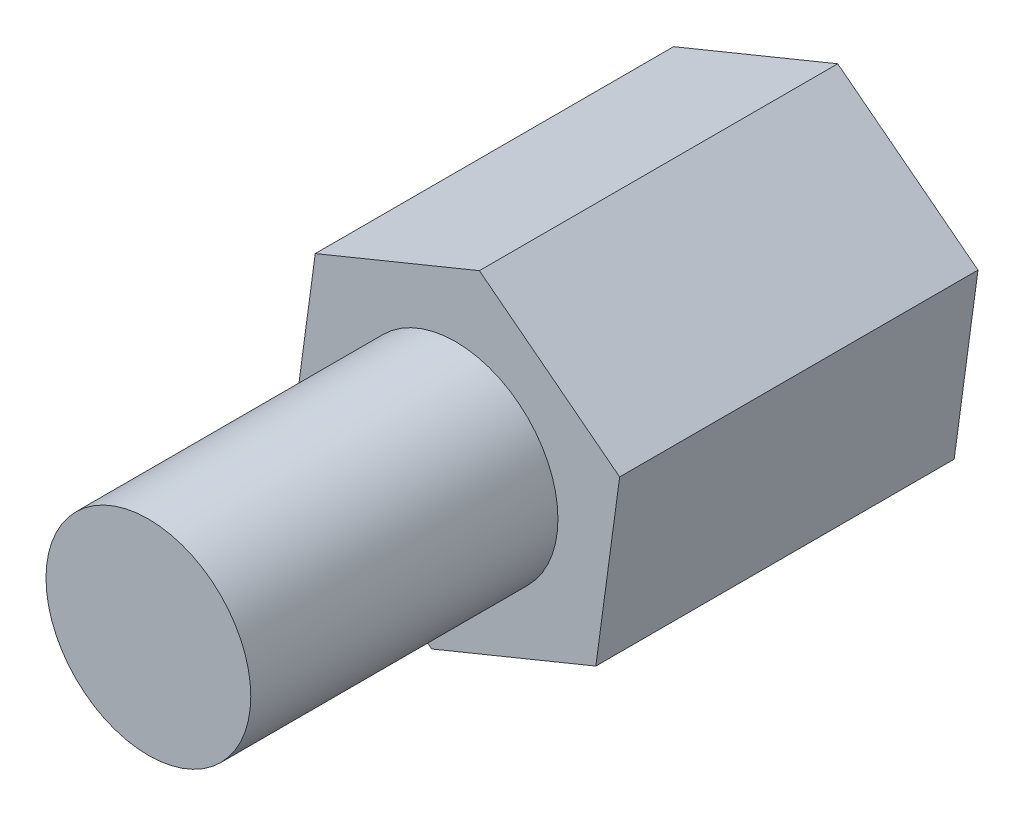
ISO-10303-21;
HEADER;
FILE_DESCRIPTION(('STEP AP214'),'2;1');
FILE_NAME('part.step','',(''),(''),'','','');
FILE_SCHEMA(('AUTOMOTIVE_DESIGN { 1 0 10303 214 1 1 1 1 }'));
ENDSEC;
DATA;
#1=APPLICATION_CONTEXT('core data for automotive mechanical design processes');
#2=APPLICATION_PROTOCOL_DEFINITION('international standard','automotive_design',2000,#1);
#3=PRODUCT_CONTEXT('',#1,'mechanical');
#4=PRODUCT('Part','Part','',(#3));
#5=PRODUCT_RELATED_PRODUCT_CATEGORY('part','',(#4));
#6=PRODUCT_DEFINITION_FORMATION('','',#4);
#7=PRODUCT_DEFINITION_CONTEXT('part definition',#1,'design');
#8=PRODUCT_DEFINITION('design','',#6,#7);
#9=PRODUCT_DEFINITION_SHAPE('','',#8);
#10=(LENGTH_UNIT() NAMED_UNIT(*) SI_UNIT(.MILLI.,.METRE.));
#11=(NAMED_UNIT(*) PLANE_ANGLE_UNIT() SI_UNIT($,.RADIAN.));
#12=(NAMED_UNIT(*) SI_UNIT($,.STERADIAN.) SOLID_ANGLE_UNIT());
#13=UNCERTAINTY_MEASURE_WITH_UNIT(LENGTH_MEASURE(1.E-05),#10,'distance_accuracy_value','');
#14=(GEOMETRIC_REPRESENTATION_CONTEXT(3) GLOBAL_UNCERTAINTY_ASSIGNED_CONTEXT((#13)) GLOBAL_UNIT_ASSIGNED_CONTEXT((#10,
#11,#12)) REPRESENTATION_CONTEXT('',''));
#15=CARTESIAN_POINT('',(0.,0.,0.));
#16=DIRECTION('',(0.,0.,1.));
#17=DIRECTION('',(1.,0.,0.));
#18=AXIS2_PLACEMENT_3D('',#15,#16,#17);
#19=CARTESIAN_POINT('',(-0.465240047696353,-3.43271782965328,7.));
#20=DIRECTION('',(-0.379160128826499,0.92533107410714,0.));
#21=DIRECTION('',(-0.92533107410714,-0.379160128826499,0.));
#22=AXIS2_PLACEMENT_3D('',#19,#20,#21);
#23=PLANE('',#22);
#24=DIRECTION('',(0.92533107410714,0.379160128826499,0.));
#25=VECTOR('',#24,1.);
#26=CARTESIAN_POINT('',(-0.465240047696353,-3.43271782965328,0.));
#27=LINE('',#26,#25);
#28=CARTESIAN_POINT('',(-0.465240047696353,-3.43271782965328,0.));
#29=VERTEX_POINT('',#28);
#30=CARTESIAN_POINT('',(2.74020082065534,-2.11926861498956,0.));
#31=VERTEX_POINT('',#30);
#32=EDGE_CURVE('E122',#29,#31,#27,.T.);
#33=ORIENTED_EDGE('',*,*,#32,.T.);
#34=DIRECTION('',(0.,0.,-1.));
#35=VECTOR('',#34,1.);
#36=CARTESIAN_POINT('',(2.74020082065534,-2.11926861498956,7.));
#37=LINE('',#36,#35);
#38=CARTESIAN_POINT('',(2.74020082065534,-2.11926861498956,7.));
#39=VERTEX_POINT('',#38);
#40=EDGE_CURVE('E39',#39,#31,#37,.T.);
#41=ORIENTED_EDGE('',*,*,#40,.F.);
#42=DIRECTION('',(0.92533107410714,0.379160128826499,0.));
#43=VECTOR('',#42,1.);
#44=CARTESIAN_POINT('',(-0.465240047696353,-3.43271782965328,7.));
#45=LINE('',#44,#43);
#46=CARTESIAN_POINT('',(-0.465240047696353,-3.43271782965328,7.));
#47=VERTEX_POINT('',#46);
#48=EDGE_CURVE('E133',#47,#39,#45,.T.);
#49=ORIENTED_EDGE('',*,*,#48,.F.);
#50=DIRECTION('',(0.,0.,-1.));
#51=VECTOR('',#50,1.);
#52=CARTESIAN_POINT('',(-0.465240047696353,-3.43271782965328,7.));
#53=LINE('',#52,#51);
#54=EDGE_CURVE('E118',#47,#29,#53,.T.);
#55=ORIENTED_EDGE('',*,*,#54,.T.);
#56=EDGE_LOOP('',(#33,#41,#49,#55));
#57=FACE_BOUND('',#56,.T.);
#58=ADVANCED_FACE('F36',(#57),#23,.F.);
#59=CARTESIAN_POINT('',(2.74020082065534,-2.11926861498956,7.));
#60=DIRECTION('',(-0.990940281501173,0.134303233387642,0.));
#61=DIRECTION('',(-0.134303233387642,-0.990940281501174,0.));
#62=AXIS2_PLACEMENT_3D('',#59,#60,#61);
#63=PLANE('',#62);
#64=DIRECTION('',(0.134303233387642,0.990940281501173,0.));
#65=VECTOR('',#64,1.);
#66=CARTESIAN_POINT('',(2.74020082065534,-2.11926861498956,0.));
#67=LINE('',#66,#65);
#68=CARTESIAN_POINT('',(3.2054408683517,1.31344921466371,0.));
#69=VERTEX_POINT('',#68);
#70=EDGE_CURVE('E125',#31,#69,#67,.T.);
#71=ORIENTED_EDGE('',*,*,#70,.T.);
#72=DIRECTION('',(0.,0.,-1.));
#73=VECTOR('',#72,1.);
#74=CARTESIAN_POINT('',(3.2054408683517,1.31344921466371,7.));
#75=LINE('',#74,#73);
#76=CARTESIAN_POINT('',(3.2054408683517,1.31344921466371,7.));
#77=VERTEX_POINT('',#76);
#78=EDGE_CURVE('E136',#77,#69,#75,.T.);
#79=ORIENTED_EDGE('',*,*,#78,.F.);
#80=DIRECTION('',(0.134303233387642,0.990940281501173,0.));
#81=VECTOR('',#80,1.);
#82=CARTESIAN_POINT('',(2.74020082065534,-2.11926861498956,7.));
#83=LINE('',#82,#81);
#84=EDGE_CURVE('E91',#39,#77,#83,.T.);
#85=ORIENTED_EDGE('',*,*,#84,.F.);
#86=ORIENTED_EDGE('',*,*,#40,.T.);
#87=EDGE_LOOP('',(#71,#79,#85,#86));
#88=FACE_BOUND('',#87,.T.);
#89=ADVANCED_FACE('F141',(#88),#63,.F.);
#90=CARTESIAN_POINT('',(3.2054408683517,1.31344921466371,7.));
#91=DIRECTION('',(-0.611780152674675,-0.791027840719498,0.));
#92=DIRECTION('',(0.791027840719498,-0.611780152674675,0.));
#93=AXIS2_PLACEMENT_3D('',#90,#91,#92);
#94=PLANE('',#93);
#95=DIRECTION('',(-0.791027840719498,0.611780152674675,0.));
#96=VECTOR('',#95,1.);
#97=CARTESIAN_POINT('',(3.2054408683517,1.31344921466371,0.));
#98=LINE('',#97,#96);
#99=CARTESIAN_POINT('',(0.465240047696353,3.43271782965328,0.));
#100=VERTEX_POINT('',#99);
#101=EDGE_CURVE('E128',#69,#100,#98,.T.);
#102=ORIENTED_EDGE('',*,*,#101,.T.);
#103=DIRECTION('',(0.,0.,-1.));
#104=VECTOR('',#103,1.);
#105=CARTESIAN_POINT('',(0.465240047696353,3.43271782965328,7.));
#106=LINE('',#105,#104);
#107=CARTESIAN_POINT('',(0.465240047696353,3.43271782965328,7.));
#108=VERTEX_POINT('',#107);
#109=EDGE_CURVE('E113',#108,#100,#106,.T.);
#110=ORIENTED_EDGE('',*,*,#109,.F.);
#111=DIRECTION('',(-0.791027840719498,0.611780152674675,0.));
#112=VECTOR('',#111,1.);
#113=CARTESIAN_POINT('',(3.2054408683517,1.31344921466371,7.));
#114=LINE('',#113,#112);
#115=EDGE_CURVE('E104',#77,#108,#114,.T.);
#116=ORIENTED_EDGE('',*,*,#115,.F.);
#117=ORIENTED_EDGE('',*,*,#78,.T.);
#118=EDGE_LOOP('',(#102,#110,#116,#117));
#119=FACE_BOUND('',#118,.T.);
#120=ADVANCED_FACE('F147',(#119),#94,.F.);
#121=CARTESIAN_POINT('',(0.465240047696353,3.43271782965328,7.));
#122=DIRECTION('',(0.379160128826498,-0.92533107410714,0.));
#123=DIRECTION('',(0.92533107410714,0.379160128826498,0.));
#124=AXIS2_PLACEMENT_3D('',#121,#122,#123);
#125=PLANE('',#124);
#126=DIRECTION('',(-0.92533107410714,-0.379160128826498,0.));
#127=VECTOR('',#126,1.);
#128=CARTESIAN_POINT('',(0.465240047696353,3.43271782965328,0.));
#129=LINE('',#128,#127);
#130=CARTESIAN_POINT('',(-2.74020082065534,2.11926861498956,0.));
#131=VERTEX_POINT('',#130);
#132=EDGE_CURVE('E112',#100,#131,#129,.T.);
#133=ORIENTED_EDGE('',*,*,#132,.T.);
#134=DIRECTION('',(0.,0.,-1.));
#135=VECTOR('',#134,1.);
#136=CARTESIAN_POINT('',(-2.74020082065534,2.11926861498956,7.));
#137=LINE('',#136,#135);
#138=CARTESIAN_POINT('',(-2.74020082065534,2.11926861498956,7.));
#139=VERTEX_POINT('',#138);
#140=EDGE_CURVE('E109',#139,#131,#137,.T.);
#141=ORIENTED_EDGE('',*,*,#140,.F.);
#142=DIRECTION('',(-0.92533107410714,-0.379160128826498,0.));
#143=VECTOR('',#142,1.);
#144=CARTESIAN_POINT('',(0.465240047696353,3.43271782965328,7.));
#145=LINE('',#144,#143);
#146=EDGE_CURVE('E98',#108,#139,#145,.T.);
#147=ORIENTED_EDGE('',*,*,#146,.F.);
#148=ORIENTED_EDGE('',*,*,#109,.T.);
#149=EDGE_LOOP('',(#133,#141,#147,#148));
#150=FACE_BOUND('',#149,.T.);
#151=ADVANCED_FACE('F110',(#150),#125,.F.);
#152=CARTESIAN_POINT('',(-2.74020082065534,2.11926861498956,7.));
#153=DIRECTION('',(0.990940281501173,-0.134303233387642,0.));
#154=DIRECTION('',(0.134303233387642,0.990940281501173,0.));
#155=AXIS2_PLACEMENT_3D('',#152,#153,#154);
#156=PLANE('',#155);
#157=DIRECTION('',(-0.134303233387642,-0.990940281501173,0.));
#158=VECTOR('',#157,1.);
#159=CARTESIAN_POINT('',(-2.74020082065534,2.11926861498956,0.));
#160=LINE('',#159,#158);
#161=CARTESIAN_POINT('',(-3.2054408683517,-1.31344921466371,0.));
#162=VERTEX_POINT('',#161);
#163=EDGE_CURVE('E76',#131,#162,#160,.T.);
#164=ORIENTED_EDGE('',*,*,#163,.T.);
#165=DIRECTION('',(0.,0.,-1.));
#166=VECTOR('',#165,1.);
#167=CARTESIAN_POINT('',(-3.2054408683517,-1.31344921466371,7.));
#168=LINE('',#167,#166);
#169=CARTESIAN_POINT('',(-3.2054408683517,-1.31344921466371,7.));
#170=VERTEX_POINT('',#169);
#171=EDGE_CURVE('E114',#170,#162,#168,.T.);
#172=ORIENTED_EDGE('',*,*,#171,.F.);
#173=DIRECTION('',(-0.134303233387642,-0.990940281501173,0.));
#174=VECTOR('',#173,1.);
#175=CARTESIAN_POINT('',(-2.74020082065534,2.11926861498956,7.));
#176=LINE('',#175,#174);
#177=EDGE_CURVE('E102',#139,#170,#176,.T.);
#178=ORIENTED_EDGE('',*,*,#177,.F.);
#179=ORIENTED_EDGE('',*,*,#140,.T.);
#180=EDGE_LOOP('',(#164,#172,#178,#179));
#181=FACE_BOUND('',#180,.T.);
#182=ADVANCED_FACE('F116',(#181),#156,.F.);
#183=CARTESIAN_POINT('',(-3.2054408683517,-1.31344921466371,7.));
#184=DIRECTION('',(0.611780152674675,0.791027840719498,0.));
#185=DIRECTION('',(-0.791027840719498,0.611780152674675,0.));
#186=AXIS2_PLACEMENT_3D('',#183,#184,#185);
#187=PLANE('',#186);
#188=DIRECTION('',(0.791027840719498,-0.611780152674675,0.));
#189=VECTOR('',#188,1.);
#190=CARTESIAN_POINT('',(-3.2054408683517,-1.31344921466371,0.));
#191=LINE('',#190,#189);
#192=EDGE_CURVE('E82',#162,#29,#191,.T.);
#193=ORIENTED_EDGE('',*,*,#192,.T.);
#194=ORIENTED_EDGE('',*,*,#54,.F.);
#195=DIRECTION('',(0.791027840719498,-0.611780152674675,0.));
#196=VECTOR('',#195,1.);
#197=CARTESIAN_POINT('',(-3.2054408683517,-1.31344921466371,7.));
#198=LINE('',#197,#196);
#199=EDGE_CURVE('E53',#170,#47,#198,.T.);
#200=ORIENTED_EDGE('',*,*,#199,.F.);
#201=ORIENTED_EDGE('',*,*,#171,.T.);
#202=EDGE_LOOP('',(#193,#194,#200,#201));
#203=FACE_BOUND('',#202,.T.);
#204=ADVANCED_FACE('F178',(#203),#187,.F.);
#205=CARTESIAN_POINT('',(0.,0.,7.));
#206=DIRECTION('',(0.,0.,1.));
#207=DIRECTION('',(1.,0.,0.));
#208=AXIS2_PLACEMENT_3D('',#205,#206,#207);
#209=PLANE('',#208);
#210=CARTESIAN_POINT('',(0.,0.,7.));
#211=DIRECTION('',(0.,0.,1.));
#212=DIRECTION('',(1.,0.,0.));
#213=AXIS2_PLACEMENT_3D('',#210,#211,#212);
#214=CIRCLE('',#213,2.);
#215=CARTESIAN_POINT('',(2.,0.,7.));
#216=VERTEX_POINT('',#215);
#217=EDGE_CURVE('E11',#216,#216,#214,.T.);
#218=ORIENTED_EDGE('',*,*,#217,.F.);
#219=EDGE_LOOP('',(#218));
#220=FACE_BOUND('',#219,.T.);
#221=ORIENTED_EDGE('',*,*,#48,.T.);
#222=ORIENTED_EDGE('',*,*,#84,.T.);
#223=ORIENTED_EDGE('',*,*,#115,.T.);
#224=ORIENTED_EDGE('',*,*,#146,.T.);
#225=ORIENTED_EDGE('',*,*,#177,.T.);
#226=ORIENTED_EDGE('',*,*,#199,.T.);
#227=EDGE_LOOP('',(#221,#222,#223,#224,#225,#226));
#228=FACE_BOUND('',#227,.T.);
#229=ADVANCED_FACE('F100',(#220,#228),#209,.T.);
#230=CARTESIAN_POINT('',(0.,0.,0.));
#231=DIRECTION('',(0.,0.,1.));
#232=DIRECTION('',(1.,0.,0.));
#233=AXIS2_PLACEMENT_3D('',#230,#231,#232);
#234=PLANE('',#233);
#235=CARTESIAN_POINT('',(0.,0.,0.));
#236=DIRECTION('',(0.,0.,-1.));
#237=DIRECTION('',(-1.,0.,0.));
#238=AXIS2_PLACEMENT_3D('',#235,#236,#237);
#239=CIRCLE('',#238,2.);
#240=CARTESIAN_POINT('',(-2.,0.,0.));
#241=VERTEX_POINT('',#240);
#242=EDGE_CURVE('E154',#241,#241,#239,.T.);
#243=ORIENTED_EDGE('',*,*,#242,.F.);
#244=EDGE_LOOP('',(#243));
#245=FACE_BOUND('',#244,.T.);
#246=ORIENTED_EDGE('',*,*,#32,.F.);
#247=ORIENTED_EDGE('',*,*,#192,.F.);
#248=ORIENTED_EDGE('',*,*,#163,.F.);
#249=ORIENTED_EDGE('',*,*,#132,.F.);
#250=ORIENTED_EDGE('',*,*,#101,.F.);
#251=ORIENTED_EDGE('',*,*,#70,.F.);
#252=EDGE_LOOP('',(#246,#247,#248,#249,#250,#251));
#253=FACE_BOUND('',#252,.T.);
#254=ADVANCED_FACE('F146',(#245,#253),#234,.F.);
#255=CARTESIAN_POINT('',(0.,0.,13.));
#256=DIRECTION('',(0.,0.,-1.));
#257=DIRECTION('',(-1.,0.,0.));
#258=AXIS2_PLACEMENT_3D('',#255,#256,#257);
#259=CYLINDRICAL_SURFACE('',#258,2.);
#260=CARTESIAN_POINT('',(0.,0.,13.));
#261=DIRECTION('',(0.,0.,1.));
#262=DIRECTION('',(1.,0.,0.));
#263=AXIS2_PLACEMENT_3D('',#260,#261,#262);
#264=CIRCLE('',#263,2.);
#265=CARTESIAN_POINT('',(2.,0.,13.));
#266=VERTEX_POINT('',#265);
#267=EDGE_CURVE('E126',#266,#266,#264,.T.);
#268=ORIENTED_EDGE('',*,*,#267,.F.);
#269=EDGE_LOOP('',(#268));
#270=FACE_BOUND('',#269,.T.);
#271=ORIENTED_EDGE('',*,*,#217,.T.);
#272=EDGE_LOOP('',(#271));
#273=FACE_BOUND('',#272,.T.);
#274=ADVANCED_FACE('F170',(#270,#273),#259,.T.);
#275=CARTESIAN_POINT('',(0.,0.,13.));
#276=DIRECTION('',(0.,0.,1.));
#277=DIRECTION('',(1.,0.,0.));
#278=AXIS2_PLACEMENT_3D('',#275,#276,#277);
#279=PLANE('',#278);
#280=ORIENTED_EDGE('',*,*,#267,.T.);
#281=EDGE_LOOP('',(#280));
#282=FACE_BOUND('',#281,.T.);
#283=ADVANCED_FACE('F165',(#282),#279,.T.);
#284=CARTESIAN_POINT('',(0.,0.,4.));
#285=DIRECTION('',(0.,0.,-1.));
#286=DIRECTION('',(-1.,0.,0.));
#287=AXIS2_PLACEMENT_3D('',#284,#285,#286);
#288=CYLINDRICAL_SURFACE('',#287,2.);
#289=CARTESIAN_POINT('',(0.,0.,4.));
#290=DIRECTION('',(0.,0.,-1.));
#291=DIRECTION('',(-1.,0.,0.));
#292=AXIS2_PLACEMENT_3D('',#289,#290,#291);
#293=CIRCLE('',#292,2.);
#294=CARTESIAN_POINT('',(-2.,0.,4.));
#295=VERTEX_POINT('',#294);
#296=EDGE_CURVE('E153',#295,#295,#293,.T.);
#297=ORIENTED_EDGE('',*,*,#296,.F.);
#298=EDGE_LOOP('',(#297));
#299=FACE_BOUND('',#298,.T.);
#300=ORIENTED_EDGE('',*,*,#242,.T.);
#301=EDGE_LOOP('',(#300));
#302=FACE_BOUND('',#301,.T.);
#303=ADVANCED_FACE('F162',(#299,#302),#288,.F.);
#304=CARTESIAN_POINT('',(0.,0.,4.));
#305=DIRECTION('',(0.,0.,-1.));
#306=DIRECTION('',(-1.,0.,0.));
#307=AXIS2_PLACEMENT_3D('',#304,#305,#306);
#308=PLANE('',#307);
#309=ORIENTED_EDGE('',*,*,#296,.T.);
#310=EDGE_LOOP('',(#309));
#311=FACE_BOUND('',#310,.T.);
#312=ADVANCED_FACE('F160',(#311),#308,.T.);
#313=CLOSED_SHELL('',(#58,#89,#120,#151,#182,#204,#229,#254,#274,#283,#303,#312));
#314=MANIFOLD_SOLID_BREP('B2',#313);
#315=ADVANCED_BREP_SHAPE_REPRESENTATION('',(#18,#314),#14);
#316=SHAPE_DEFINITION_REPRESENTATION(#9,#315);
ENDSEC;
END-ISO-10303-21;
